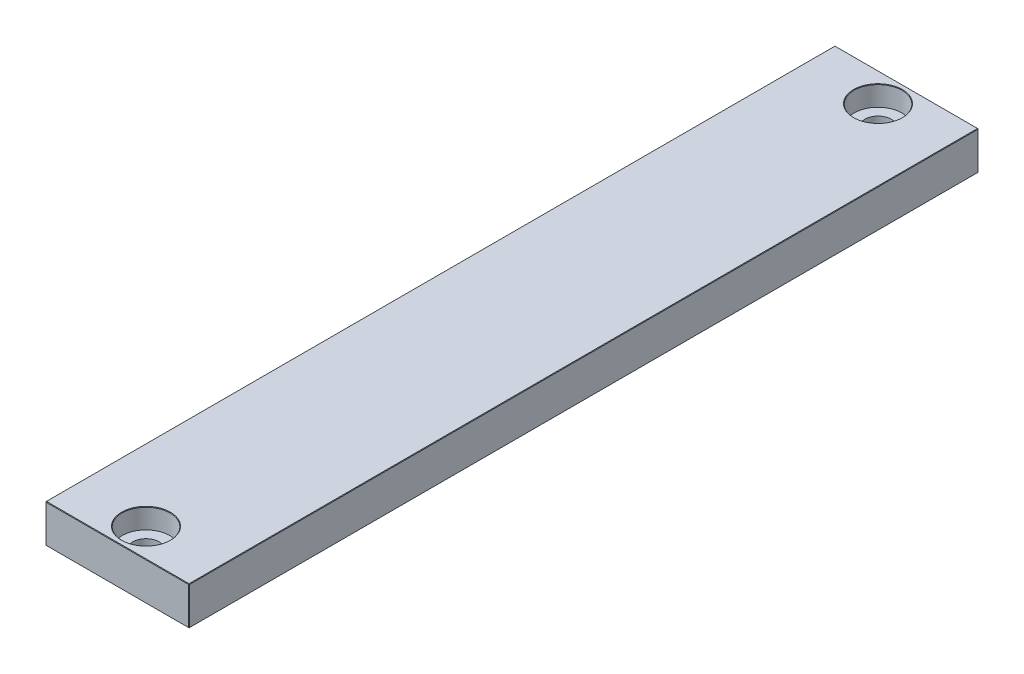
ISO-10303-21;
HEADER;
FILE_DESCRIPTION(('STEP AP214'),'2;1');
FILE_NAME('part.step','',(''),(''),'','','');
FILE_SCHEMA(('AUTOMOTIVE_DESIGN { 1 0 10303 214 1 1 1 1 }'));
ENDSEC;
DATA;
#1=APPLICATION_CONTEXT('core data for automotive mechanical design processes');
#2=APPLICATION_PROTOCOL_DEFINITION('international standard','automotive_design',2000,#1);
#3=PRODUCT_CONTEXT('',#1,'mechanical');
#4=PRODUCT('Part','Part','',(#3));
#5=PRODUCT_RELATED_PRODUCT_CATEGORY('part','',(#4));
#6=PRODUCT_DEFINITION_FORMATION('','',#4);
#7=PRODUCT_DEFINITION_CONTEXT('part definition',#1,'design');
#8=PRODUCT_DEFINITION('design','',#6,#7);
#9=PRODUCT_DEFINITION_SHAPE('','',#8);
#10=(LENGTH_UNIT() NAMED_UNIT(*) SI_UNIT(.MILLI.,.METRE.));
#11=(NAMED_UNIT(*) PLANE_ANGLE_UNIT() SI_UNIT($,.RADIAN.));
#12=(NAMED_UNIT(*) SI_UNIT($,.STERADIAN.) SOLID_ANGLE_UNIT());
#13=UNCERTAINTY_MEASURE_WITH_UNIT(LENGTH_MEASURE(1.E-05),#10,'distance_accuracy_value','');
#14=(GEOMETRIC_REPRESENTATION_CONTEXT(3) GLOBAL_UNCERTAINTY_ASSIGNED_CONTEXT((#13)) GLOBAL_UNIT_ASSIGNED_CONTEXT((#10,
#11,#12)) REPRESENTATION_CONTEXT('',''));
#15=CARTESIAN_POINT('',(0.,0.,0.));
#16=DIRECTION('',(0.,0.,1.));
#17=DIRECTION('',(1.,0.,0.));
#18=AXIS2_PLACEMENT_3D('',#15,#16,#17);
#19=CARTESIAN_POINT('',(0.,8.,-76.5));
#20=DIRECTION('',(0.,-1.,0.));
#21=DIRECTION('',(0.,0.,-1.));
#22=AXIS2_PLACEMENT_3D('',#19,#20,#21);
#23=CYLINDRICAL_SURFACE('',#22,2.75);
#24=CARTESIAN_POINT('',(0.,0.100000000000027,-76.5));
#25=DIRECTION('',(0.,-1.,0.));
#26=DIRECTION('',(0.,0.,-1.));
#27=AXIS2_PLACEMENT_3D('',#24,#25,#26);
#28=CIRCLE('',#27,2.75);
#29=CARTESIAN_POINT('',(0.,0.100000000000027,-79.25));
#30=VERTEX_POINT('',#29);
#31=EDGE_CURVE('E266',#30,#30,#28,.T.);
#32=ORIENTED_EDGE('',*,*,#31,.T.);
#33=EDGE_LOOP('',(#32));
#34=FACE_BOUND('',#33,.T.);
#35=CARTESIAN_POINT('',(0.,3.8,-76.5));
#36=DIRECTION('',(0.,1.,0.));
#37=DIRECTION('',(0.,0.,1.));
#38=AXIS2_PLACEMENT_3D('',#35,#36,#37);
#39=CIRCLE('',#38,2.75);
#40=CARTESIAN_POINT('',(0.,3.8,-73.75));
#41=VERTEX_POINT('',#40);
#42=EDGE_CURVE('E155',#41,#41,#39,.T.);
#43=ORIENTED_EDGE('',*,*,#42,.T.);
#44=EDGE_LOOP('',(#43));
#45=FACE_BOUND('',#44,.T.);
#46=ADVANCED_FACE('F41',(#34,#45),#23,.F.);
#47=CARTESIAN_POINT('',(0.,8.,76.5));
#48=DIRECTION('',(0.,-1.,0.));
#49=DIRECTION('',(0.,0.,-1.));
#50=AXIS2_PLACEMENT_3D('',#47,#48,#49);
#51=CYLINDRICAL_SURFACE('',#50,2.75);
#52=CARTESIAN_POINT('',(0.,0.100000000000029,76.5));
#53=DIRECTION('',(0.,-1.,0.));
#54=DIRECTION('',(0.,0.,-1.));
#55=AXIS2_PLACEMENT_3D('',#52,#53,#54);
#56=CIRCLE('',#55,2.75);
#57=CARTESIAN_POINT('',(0.,0.100000000000029,73.75));
#58=VERTEX_POINT('',#57);
#59=EDGE_CURVE('E270',#58,#58,#56,.T.);
#60=ORIENTED_EDGE('',*,*,#59,.T.);
#61=EDGE_LOOP('',(#60));
#62=FACE_BOUND('',#61,.T.);
#63=CARTESIAN_POINT('',(0.,3.8,76.5));
#64=DIRECTION('',(0.,1.,0.));
#65=DIRECTION('',(0.,0.,1.));
#66=AXIS2_PLACEMENT_3D('',#63,#64,#65);
#67=CIRCLE('',#66,2.75);
#68=CARTESIAN_POINT('',(0.,3.8,79.25));
#69=VERTEX_POINT('',#68);
#70=EDGE_CURVE('E245',#69,#69,#67,.T.);
#71=ORIENTED_EDGE('',*,*,#70,.T.);
#72=EDGE_LOOP('',(#71));
#73=FACE_BOUND('',#72,.T.);
#74=ADVANCED_FACE('F439',(#62,#73),#51,.F.);
#75=CARTESIAN_POINT('',(0.,8.,0.));
#76=DIRECTION('',(0.,-1.,0.));
#77=DIRECTION('',(0.,0.,-1.));
#78=AXIS2_PLACEMENT_3D('',#75,#76,#77);
#79=PLANE('',#78);
#80=CARTESIAN_POINT('',(0.,8.,76.5));
#81=DIRECTION('',(0.,-1.,0.));
#82=DIRECTION('',(0.,0.,-1.));
#83=AXIS2_PLACEMENT_3D('',#80,#81,#82);
#84=CIRCLE('',#83,5.09999999999999);
#85=CARTESIAN_POINT('',(0.,8.,71.4));
#86=VERTEX_POINT('',#85);
#87=EDGE_CURVE('E295',#86,#86,#84,.T.);
#88=ORIENTED_EDGE('',*,*,#87,.T.);
#89=EDGE_LOOP('',(#88));
#90=FACE_BOUND('',#89,.T.);
#91=CARTESIAN_POINT('',(0.,8.,-76.5));
#92=DIRECTION('',(0.,-1.,0.));
#93=DIRECTION('',(0.,0.,-1.));
#94=AXIS2_PLACEMENT_3D('',#91,#92,#93);
#95=CIRCLE('',#94,5.09999999999999);
#96=CARTESIAN_POINT('',(0.,8.,-81.6));
#97=VERTEX_POINT('',#96);
#98=EDGE_CURVE('E291',#97,#97,#95,.T.);
#99=ORIENTED_EDGE('',*,*,#98,.T.);
#100=EDGE_LOOP('',(#99));
#101=FACE_BOUND('',#100,.T.);
#102=DIRECTION('',(0.,0.,1.));
#103=VECTOR('',#102,1.);
#104=CARTESIAN_POINT('',(-14.9,8.,0.));
#105=LINE('',#104,#103);
#106=CARTESIAN_POINT('',(-14.9,8.,-82.4));
#107=VERTEX_POINT('',#106);
#108=CARTESIAN_POINT('',(-14.9,8.,82.4));
#109=VERTEX_POINT('',#108);
#110=EDGE_CURVE('E281',#107,#109,#105,.T.);
#111=ORIENTED_EDGE('',*,*,#110,.T.);
#112=DIRECTION('',(1.,0.,0.));
#113=VECTOR('',#112,1.);
#114=CARTESIAN_POINT('',(0.,8.,82.4));
#115=LINE('',#114,#113);
#116=CARTESIAN_POINT('',(14.9,8.,82.4));
#117=VERTEX_POINT('',#116);
#118=EDGE_CURVE('E287',#109,#117,#115,.T.);
#119=ORIENTED_EDGE('',*,*,#118,.T.);
#120=DIRECTION('',(0.,0.,-1.));
#121=VECTOR('',#120,1.);
#122=CARTESIAN_POINT('',(14.9,8.,0.));
#123=LINE('',#122,#121);
#124=CARTESIAN_POINT('',(14.9,8.,-82.4));
#125=VERTEX_POINT('',#124);
#126=EDGE_CURVE('E284',#117,#125,#123,.T.);
#127=ORIENTED_EDGE('',*,*,#126,.T.);
#128=DIRECTION('',(-1.,0.,0.));
#129=VECTOR('',#128,1.);
#130=CARTESIAN_POINT('',(0.,8.,-82.4));
#131=LINE('',#130,#129);
#132=EDGE_CURVE('E278',#125,#107,#131,.T.);
#133=ORIENTED_EDGE('',*,*,#132,.T.);
#134=EDGE_LOOP('',(#111,#119,#127,#133));
#135=FACE_BOUND('',#134,.T.);
#136=ADVANCED_FACE('F407',(#90,#101,#135),#79,.F.);
#137=CARTESIAN_POINT('',(0.,0.,0.));
#138=DIRECTION('',(0.,-1.,0.));
#139=DIRECTION('',(0.,0.,-1.));
#140=AXIS2_PLACEMENT_3D('',#137,#138,#139);
#141=PLANE('',#140);
#142=CARTESIAN_POINT('',(0.,0.,-76.5));
#143=DIRECTION('',(0.,-1.,0.));
#144=DIRECTION('',(0.,0.,-1.));
#145=AXIS2_PLACEMENT_3D('',#142,#143,#144);
#146=CIRCLE('',#145,2.85000000000003);
#147=CARTESIAN_POINT('',(0.,0.,-79.35));
#148=VERTEX_POINT('',#147);
#149=EDGE_CURVE('E262',#148,#148,#146,.F.);
#150=ORIENTED_EDGE('',*,*,#149,.T.);
#151=EDGE_LOOP('',(#150));
#152=FACE_BOUND('',#151,.T.);
#153=CARTESIAN_POINT('',(0.,0.,76.5));
#154=DIRECTION('',(0.,-1.,0.));
#155=DIRECTION('',(0.,0.,-1.));
#156=AXIS2_PLACEMENT_3D('',#153,#154,#155);
#157=CIRCLE('',#156,2.85000000000003);
#158=CARTESIAN_POINT('',(0.,0.,73.65));
#159=VERTEX_POINT('',#158);
#160=EDGE_CURVE('E258',#159,#159,#157,.F.);
#161=ORIENTED_EDGE('',*,*,#160,.T.);
#162=EDGE_LOOP('',(#161));
#163=FACE_BOUND('',#162,.T.);
#164=DIRECTION('',(0.,0.,-1.));
#165=VECTOR('',#164,1.);
#166=CARTESIAN_POINT('',(-14.9,0.,-82.5));
#167=LINE('',#166,#165);
#168=CARTESIAN_POINT('',(-14.9,0.,82.4));
#169=VERTEX_POINT('',#168);
#170=CARTESIAN_POINT('',(-14.9,0.,-82.4));
#171=VERTEX_POINT('',#170);
#172=EDGE_CURVE('E143',#169,#171,#167,.T.);
#173=ORIENTED_EDGE('',*,*,#172,.T.);
#174=DIRECTION('',(1.,0.,0.));
#175=VECTOR('',#174,1.);
#176=CARTESIAN_POINT('',(15.,0.,-82.4));
#177=LINE('',#176,#175);
#178=CARTESIAN_POINT('',(14.9,0.,-82.4));
#179=VERTEX_POINT('',#178);
#180=EDGE_CURVE('E138',#171,#179,#177,.T.);
#181=ORIENTED_EDGE('',*,*,#180,.T.);
#182=DIRECTION('',(0.,0.,1.));
#183=VECTOR('',#182,1.);
#184=CARTESIAN_POINT('',(14.9,0.,82.5));
#185=LINE('',#184,#183);
#186=CARTESIAN_POINT('',(14.9,0.,82.4));
#187=VERTEX_POINT('',#186);
#188=EDGE_CURVE('E132',#179,#187,#185,.T.);
#189=ORIENTED_EDGE('',*,*,#188,.T.);
#190=DIRECTION('',(-1.,0.,0.));
#191=VECTOR('',#190,1.);
#192=CARTESIAN_POINT('',(-15.,0.,82.4));
#193=LINE('',#192,#191);
#194=EDGE_CURVE('E135',#187,#169,#193,.T.);
#195=ORIENTED_EDGE('',*,*,#194,.T.);
#196=EDGE_LOOP('',(#173,#181,#189,#195));
#197=FACE_BOUND('',#196,.T.);
#198=ADVANCED_FACE('F134',(#152,#163,#197),#141,.T.);
#199=CARTESIAN_POINT('',(15.,8.,82.5));
#200=DIRECTION('',(-1.,0.,0.));
#201=DIRECTION('',(0.,0.,1.));
#202=AXIS2_PLACEMENT_3D('',#199,#200,#201);
#203=PLANE('',#202);
#204=DIRECTION('',(0.,0.,-1.));
#205=VECTOR('',#204,1.);
#206=CARTESIAN_POINT('',(15.,0.100000000000003,-82.5));
#207=LINE('',#206,#205);
#208=CARTESIAN_POINT('',(15.,0.100000000000003,82.4));
#209=VERTEX_POINT('',#208);
#210=CARTESIAN_POINT('',(15.,0.100000000000003,-82.4));
#211=VERTEX_POINT('',#210);
#212=EDGE_CURVE('E168',#209,#211,#207,.T.);
#213=ORIENTED_EDGE('',*,*,#212,.T.);
#214=DIRECTION('',(0.,1.,0.));
#215=VECTOR('',#214,1.);
#216=CARTESIAN_POINT('',(15.,8.,-82.4));
#217=LINE('',#216,#215);
#218=CARTESIAN_POINT('',(15.,7.9,-82.4));
#219=VERTEX_POINT('',#218);
#220=EDGE_CURVE('E324',#211,#219,#217,.T.);
#221=ORIENTED_EDGE('',*,*,#220,.T.);
#222=DIRECTION('',(0.,0.,1.));
#223=VECTOR('',#222,1.);
#224=CARTESIAN_POINT('',(15.,7.9,82.5));
#225=LINE('',#224,#223);
#226=CARTESIAN_POINT('',(15.,7.9,82.4));
#227=VERTEX_POINT('',#226);
#228=EDGE_CURVE('E316',#219,#227,#225,.T.);
#229=ORIENTED_EDGE('',*,*,#228,.T.);
#230=DIRECTION('',(0.,-1.,0.));
#231=VECTOR('',#230,1.);
#232=CARTESIAN_POINT('',(15.,8.,82.4));
#233=LINE('',#232,#231);
#234=EDGE_CURVE('E319',#227,#209,#233,.T.);
#235=ORIENTED_EDGE('',*,*,#234,.T.);
#236=EDGE_LOOP('',(#213,#221,#229,#235));
#237=FACE_BOUND('',#236,.T.);
#238=ADVANCED_FACE('F382',(#237),#203,.F.);
#239=CARTESIAN_POINT('',(-15.,8.,-82.5));
#240=DIRECTION('',(0.,0.,1.));
#241=DIRECTION('',(1.,0.,0.));
#242=AXIS2_PLACEMENT_3D('',#239,#240,#241);
#243=PLANE('',#242);
#244=DIRECTION('',(1.,0.,0.));
#245=VECTOR('',#244,1.);
#246=CARTESIAN_POINT('',(-15.,7.9,-82.5));
#247=LINE('',#246,#245);
#248=CARTESIAN_POINT('',(-14.9,7.9,-82.5));
#249=VERTEX_POINT('',#248);
#250=CARTESIAN_POINT('',(14.9,7.9,-82.5));
#251=VERTEX_POINT('',#250);
#252=EDGE_CURVE('E303',#249,#251,#247,.T.);
#253=ORIENTED_EDGE('',*,*,#252,.T.);
#254=DIRECTION('',(0.,-1.,0.));
#255=VECTOR('',#254,1.);
#256=CARTESIAN_POINT('',(14.9,8.,-82.5));
#257=LINE('',#256,#255);
#258=CARTESIAN_POINT('',(14.9,0.100000000000003,-82.5));
#259=VERTEX_POINT('',#258);
#260=EDGE_CURVE('E312',#251,#259,#257,.T.);
#261=ORIENTED_EDGE('',*,*,#260,.T.);
#262=DIRECTION('',(-1.,0.,0.));
#263=VECTOR('',#262,1.);
#264=CARTESIAN_POINT('',(-15.,0.100000000000003,-82.5));
#265=LINE('',#264,#263);
#266=CARTESIAN_POINT('',(-14.9,0.100000000000003,-82.5));
#267=VERTEX_POINT('',#266);
#268=EDGE_CURVE('E309',#259,#267,#265,.T.);
#269=ORIENTED_EDGE('',*,*,#268,.T.);
#270=DIRECTION('',(0.,1.,0.));
#271=VECTOR('',#270,1.);
#272=CARTESIAN_POINT('',(-14.9,8.,-82.5));
#273=LINE('',#272,#271);
#274=EDGE_CURVE('E306',#267,#249,#273,.T.);
#275=ORIENTED_EDGE('',*,*,#274,.T.);
#276=EDGE_LOOP('',(#253,#261,#269,#275));
#277=FACE_BOUND('',#276,.T.);
#278=ADVANCED_FACE('F395',(#277),#243,.F.);
#279=CARTESIAN_POINT('',(-15.,8.,82.5));
#280=DIRECTION('',(1.,0.,0.));
#281=DIRECTION('',(0.,0.,-1.));
#282=AXIS2_PLACEMENT_3D('',#279,#280,#281);
#283=PLANE('',#282);
#284=DIRECTION('',(0.,0.,-1.));
#285=VECTOR('',#284,1.);
#286=CARTESIAN_POINT('',(-15.,7.9,82.5));
#287=LINE('',#286,#285);
#288=CARTESIAN_POINT('',(-15.,7.9,82.4));
#289=VERTEX_POINT('',#288);
#290=CARTESIAN_POINT('',(-15.,7.9,-82.4));
#291=VERTEX_POINT('',#290);
#292=EDGE_CURVE('E328',#289,#291,#287,.T.);
#293=ORIENTED_EDGE('',*,*,#292,.T.);
#294=DIRECTION('',(0.,-1.,0.));
#295=VECTOR('',#294,1.);
#296=CARTESIAN_POINT('',(-15.,8.,-82.4));
#297=LINE('',#296,#295);
#298=CARTESIAN_POINT('',(-15.,0.100000000000003,-82.4));
#299=VERTEX_POINT('',#298);
#300=EDGE_CURVE('E337',#291,#299,#297,.T.);
#301=ORIENTED_EDGE('',*,*,#300,.T.);
#302=DIRECTION('',(0.,0.,1.));
#303=VECTOR('',#302,1.);
#304=CARTESIAN_POINT('',(-15.,0.100000000000003,82.5));
#305=LINE('',#304,#303);
#306=CARTESIAN_POINT('',(-15.,0.100000000000003,82.4));
#307=VERTEX_POINT('',#306);
#308=EDGE_CURVE('E334',#299,#307,#305,.T.);
#309=ORIENTED_EDGE('',*,*,#308,.T.);
#310=DIRECTION('',(0.,1.,0.));
#311=VECTOR('',#310,1.);
#312=CARTESIAN_POINT('',(-15.,8.,82.4));
#313=LINE('',#312,#311);
#314=EDGE_CURVE('E331',#307,#289,#313,.T.);
#315=ORIENTED_EDGE('',*,*,#314,.T.);
#316=EDGE_LOOP('',(#293,#301,#309,#315));
#317=FACE_BOUND('',#316,.T.);
#318=ADVANCED_FACE('F459',(#317),#283,.F.);
#319=CARTESIAN_POINT('',(-15.,8.,82.5));
#320=DIRECTION('',(0.,0.,-1.));
#321=DIRECTION('',(-1.,0.,0.));
#322=AXIS2_PLACEMENT_3D('',#319,#320,#321);
#323=PLANE('',#322);
#324=DIRECTION('',(1.,0.,0.));
#325=VECTOR('',#324,1.);
#326=CARTESIAN_POINT('',(15.,0.100000000000003,82.5));
#327=LINE('',#326,#325);
#328=CARTESIAN_POINT('',(-14.9,0.100000000000003,82.5));
#329=VERTEX_POINT('',#328);
#330=CARTESIAN_POINT('',(14.9,0.100000000000003,82.5));
#331=VERTEX_POINT('',#330);
#332=EDGE_CURVE('E52',#329,#331,#327,.T.);
#333=ORIENTED_EDGE('',*,*,#332,.T.);
#334=DIRECTION('',(0.,1.,0.));
#335=VECTOR('',#334,1.);
#336=CARTESIAN_POINT('',(14.9,8.,82.5));
#337=LINE('',#336,#335);
#338=CARTESIAN_POINT('',(14.9,7.9,82.5));
#339=VERTEX_POINT('',#338);
#340=EDGE_CURVE('E11',#331,#339,#337,.T.);
#341=ORIENTED_EDGE('',*,*,#340,.T.);
#342=DIRECTION('',(-1.,0.,0.));
#343=VECTOR('',#342,1.);
#344=CARTESIAN_POINT('',(-15.,7.9,82.5));
#345=LINE('',#344,#343);
#346=CARTESIAN_POINT('',(-14.9,7.9,82.5));
#347=VERTEX_POINT('',#346);
#348=EDGE_CURVE('E341',#339,#347,#345,.T.);
#349=ORIENTED_EDGE('',*,*,#348,.T.);
#350=DIRECTION('',(0.,-1.,0.));
#351=VECTOR('',#350,1.);
#352=CARTESIAN_POINT('',(-14.9,8.,82.5));
#353=LINE('',#352,#351);
#354=EDGE_CURVE('E63',#347,#329,#353,.T.);
#355=ORIENTED_EDGE('',*,*,#354,.T.);
#356=EDGE_LOOP('',(#333,#341,#349,#355));
#357=FACE_BOUND('',#356,.T.);
#358=ADVANCED_FACE('F418',(#357),#323,.F.);
#359=CARTESIAN_POINT('',(0.,3.8,76.5));
#360=DIRECTION('',(0.,1.,0.));
#361=DIRECTION('',(0.,0.,1.));
#362=AXIS2_PLACEMENT_3D('',#359,#360,#361);
#363=CYLINDRICAL_SURFACE('',#362,5.);
#364=CARTESIAN_POINT('',(0.,7.90000000000001,76.5));
#365=DIRECTION('',(0.,-1.,0.));
#366=DIRECTION('',(0.,0.,-1.));
#367=AXIS2_PLACEMENT_3D('',#364,#365,#366);
#368=CIRCLE('',#367,5.);
#369=CARTESIAN_POINT('',(0.,7.90000000000001,71.5));
#370=VERTEX_POINT('',#369);
#371=EDGE_CURVE('E274',#370,#370,#368,.F.);
#372=ORIENTED_EDGE('',*,*,#371,.T.);
#373=EDGE_LOOP('',(#372));
#374=FACE_BOUND('',#373,.T.);
#375=CARTESIAN_POINT('',(0.,3.8,76.5));
#376=DIRECTION('',(0.,1.,0.));
#377=DIRECTION('',(0.,0.,1.));
#378=AXIS2_PLACEMENT_3D('',#375,#376,#377);
#379=CIRCLE('',#378,5.);
#380=CARTESIAN_POINT('',(0.,3.8,81.5));
#381=VERTEX_POINT('',#380);
#382=EDGE_CURVE('E232',#381,#381,#379,.T.);
#383=ORIENTED_EDGE('',*,*,#382,.F.);
#384=EDGE_LOOP('',(#383));
#385=FACE_BOUND('',#384,.T.);
#386=ADVANCED_FACE('F458',(#374,#385),#363,.F.);
#387=CARTESIAN_POINT('',(0.,3.8,76.5));
#388=DIRECTION('',(0.,1.,0.));
#389=DIRECTION('',(0.,0.,1.));
#390=AXIS2_PLACEMENT_3D('',#387,#388,#389);
#391=PLANE('',#390);
#392=ORIENTED_EDGE('',*,*,#70,.F.);
#393=EDGE_LOOP('',(#392));
#394=FACE_BOUND('',#393,.T.);
#395=ORIENTED_EDGE('',*,*,#382,.T.);
#396=EDGE_LOOP('',(#395));
#397=FACE_BOUND('',#396,.T.);
#398=ADVANCED_FACE('F614',(#394,#397),#391,.T.);
#399=CARTESIAN_POINT('',(0.,3.8,-76.5));
#400=DIRECTION('',(0.,1.,0.));
#401=DIRECTION('',(0.,0.,1.));
#402=AXIS2_PLACEMENT_3D('',#399,#400,#401);
#403=CYLINDRICAL_SURFACE('',#402,5.);
#404=CARTESIAN_POINT('',(0.,7.90000000000001,-76.5));
#405=DIRECTION('',(0.,-1.,0.));
#406=DIRECTION('',(0.,0.,-1.));
#407=AXIS2_PLACEMENT_3D('',#404,#405,#406);
#408=CIRCLE('',#407,5.);
#409=CARTESIAN_POINT('',(0.,7.90000000000001,-81.5));
#410=VERTEX_POINT('',#409);
#411=EDGE_CURVE('E299',#410,#410,#408,.F.);
#412=ORIENTED_EDGE('',*,*,#411,.T.);
#413=EDGE_LOOP('',(#412));
#414=FACE_BOUND('',#413,.T.);
#415=CARTESIAN_POINT('',(0.,3.8,-76.5));
#416=DIRECTION('',(0.,1.,0.));
#417=DIRECTION('',(0.,0.,1.));
#418=AXIS2_PLACEMENT_3D('',#415,#416,#417);
#419=CIRCLE('',#418,5.);
#420=CARTESIAN_POINT('',(0.,3.8,-71.5));
#421=VERTEX_POINT('',#420);
#422=EDGE_CURVE('E239',#421,#421,#419,.T.);
#423=ORIENTED_EDGE('',*,*,#422,.F.);
#424=EDGE_LOOP('',(#423));
#425=FACE_BOUND('',#424,.T.);
#426=ADVANCED_FACE('F606',(#414,#425),#403,.F.);
#427=CARTESIAN_POINT('',(0.,3.8,-76.5));
#428=DIRECTION('',(0.,1.,0.));
#429=DIRECTION('',(0.,0.,1.));
#430=AXIS2_PLACEMENT_3D('',#427,#428,#429);
#431=PLANE('',#430);
#432=ORIENTED_EDGE('',*,*,#42,.F.);
#433=EDGE_LOOP('',(#432));
#434=FACE_BOUND('',#433,.T.);
#435=ORIENTED_EDGE('',*,*,#422,.T.);
#436=EDGE_LOOP('',(#435));
#437=FACE_BOUND('',#436,.T.);
#438=ADVANCED_FACE('F475',(#434,#437),#431,.T.);
#439=CARTESIAN_POINT('',(0.,0.,-76.5));
#440=DIRECTION('',(0.,-1.,0.));
#441=DIRECTION('',(0.,0.,-1.));
#442=AXIS2_PLACEMENT_3D('',#439,#440,#441);
#443=CONICAL_SURFACE('',#442,2.85000000000003,0.785398163397472);
#444=ORIENTED_EDGE('',*,*,#31,.F.);
#445=EDGE_LOOP('',(#444));
#446=FACE_BOUND('',#445,.T.);
#447=ORIENTED_EDGE('',*,*,#149,.F.);
#448=EDGE_LOOP('',(#447));
#449=FACE_BOUND('',#448,.T.);
#450=ADVANCED_FACE('F468',(#446,#449),#443,.F.);
#451=CARTESIAN_POINT('',(0.,0.,76.5));
#452=DIRECTION('',(0.,-1.,0.));
#453=DIRECTION('',(0.,0.,-1.));
#454=AXIS2_PLACEMENT_3D('',#451,#452,#453);
#455=CONICAL_SURFACE('',#454,2.85000000000003,0.785398163397468);
#456=ORIENTED_EDGE('',*,*,#59,.F.);
#457=EDGE_LOOP('',(#456));
#458=FACE_BOUND('',#457,.T.);
#459=ORIENTED_EDGE('',*,*,#160,.F.);
#460=EDGE_LOOP('',(#459));
#461=FACE_BOUND('',#460,.T.);
#462=ADVANCED_FACE('F474',(#458,#461),#455,.F.);
#463=CARTESIAN_POINT('',(0.,7.90000000000001,76.5));
#464=DIRECTION('',(0.,1.,0.));
#465=DIRECTION('',(0.,0.,1.));
#466=AXIS2_PLACEMENT_3D('',#463,#464,#465);
#467=CONICAL_SURFACE('',#466,5.,0.785398163397461);
#468=ORIENTED_EDGE('',*,*,#87,.F.);
#469=EDGE_LOOP('',(#468));
#470=FACE_BOUND('',#469,.T.);
#471=ORIENTED_EDGE('',*,*,#371,.F.);
#472=EDGE_LOOP('',(#471));
#473=FACE_BOUND('',#472,.T.);
#474=ADVANCED_FACE('F482',(#470,#473),#467,.F.);
#475=CARTESIAN_POINT('',(0.,7.90000000000001,-76.5));
#476=DIRECTION('',(0.,1.,0.));
#477=DIRECTION('',(0.,0.,1.));
#478=AXIS2_PLACEMENT_3D('',#475,#476,#477);
#479=CONICAL_SURFACE('',#478,5.,0.785398163397461);
#480=ORIENTED_EDGE('',*,*,#98,.F.);
#481=EDGE_LOOP('',(#480));
#482=FACE_BOUND('',#481,.T.);
#483=ORIENTED_EDGE('',*,*,#411,.F.);
#484=EDGE_LOOP('',(#483));
#485=FACE_BOUND('',#484,.T.);
#486=ADVANCED_FACE('F489',(#482,#485),#479,.F.);
#487=CARTESIAN_POINT('',(-14.9,8.,82.5));
#488=DIRECTION('',(0.707106781186548,0.,-0.707106781186548));
#489=DIRECTION('',(0.,-1.,0.));
#490=AXIS2_PLACEMENT_3D('',#487,#488,#489);
#491=PLANE('',#490);
#492=DIRECTION('',(-0.707106781186548,0.,-0.707106781186548));
#493=VECTOR('',#492,1.);
#494=CARTESIAN_POINT('',(-15.,7.9,82.4));
#495=LINE('',#494,#493);
#496=EDGE_CURVE('E46',#289,#347,#495,.F.);
#497=ORIENTED_EDGE('',*,*,#496,.F.);
#498=ORIENTED_EDGE('',*,*,#314,.F.);
#499=DIRECTION('',(0.707106781186548,0.,0.707106781186548));
#500=VECTOR('',#499,1.);
#501=CARTESIAN_POINT('',(-15.,0.100000000000003,82.4));
#502=LINE('',#501,#500);
#503=EDGE_CURVE('E226',#329,#307,#502,.F.);
#504=ORIENTED_EDGE('',*,*,#503,.F.);
#505=ORIENTED_EDGE('',*,*,#354,.F.);
#506=EDGE_LOOP('',(#497,#498,#504,#505));
#507=FACE_BOUND('',#506,.T.);
#508=ADVANCED_FACE('F44',(#507),#491,.F.);
#509=CARTESIAN_POINT('',(-15.,7.9,82.4));
#510=DIRECTION('',(-0.577350269189626,0.577350269189626,0.577350269189626));
#511=DIRECTION('',(0.707106781186547,0.,0.707106781186547));
#512=AXIS2_PLACEMENT_3D('',#509,#510,#511);
#513=PLANE('',#512);
#514=DIRECTION('',(0.707106781186548,0.707106781186548,0.));
#515=VECTOR('',#514,1.);
#516=CARTESIAN_POINT('',(-15.,7.9,82.4));
#517=LINE('',#516,#515);
#518=EDGE_CURVE('E219',#289,#109,#517,.T.);
#519=ORIENTED_EDGE('',*,*,#518,.F.);
#520=ORIENTED_EDGE('',*,*,#496,.T.);
#521=DIRECTION('',(0.,-0.707106781186548,0.707106781186548));
#522=VECTOR('',#521,1.);
#523=CARTESIAN_POINT('',(-14.9,7.95,82.45));
#524=LINE('',#523,#522);
#525=EDGE_CURVE('E223',#109,#347,#524,.T.);
#526=ORIENTED_EDGE('',*,*,#525,.F.);
#527=EDGE_LOOP('',(#519,#520,#526));
#528=FACE_BOUND('',#527,.T.);
#529=ADVANCED_FACE('F573',(#528),#513,.T.);
#530=CARTESIAN_POINT('',(-15.,0.100000000000003,82.4));
#531=DIRECTION('',(-0.577350269189626,-0.577350269189626,0.577350269189626));
#532=DIRECTION('',(0.707106781186547,0.,0.707106781186547));
#533=AXIS2_PLACEMENT_3D('',#530,#531,#532);
#534=PLANE('',#533);
#535=DIRECTION('',(0.,0.707106781186548,0.707106781186548));
#536=VECTOR('',#535,1.);
#537=CARTESIAN_POINT('',(-14.9,0.0500000000000014,82.45));
#538=LINE('',#537,#536);
#539=EDGE_CURVE('E152',#329,#169,#538,.F.);
#540=ORIENTED_EDGE('',*,*,#539,.F.);
#541=ORIENTED_EDGE('',*,*,#503,.T.);
#542=DIRECTION('',(0.707106781186548,-0.707106781186548,0.));
#543=VECTOR('',#542,1.);
#544=CARTESIAN_POINT('',(-15.,0.100000000000003,82.4));
#545=LINE('',#544,#543);
#546=EDGE_CURVE('E215',#169,#307,#545,.F.);
#547=ORIENTED_EDGE('',*,*,#546,.F.);
#548=EDGE_LOOP('',(#540,#541,#547));
#549=FACE_BOUND('',#548,.T.);
#550=ADVANCED_FACE('F421',(#549),#534,.T.);
#551=CARTESIAN_POINT('',(0.,8.,82.4));
#552=DIRECTION('',(0.,-0.707106781186548,-0.707106781186548));
#553=DIRECTION('',(1.,0.,0.));
#554=AXIS2_PLACEMENT_3D('',#551,#552,#553);
#555=PLANE('',#554);
#556=ORIENTED_EDGE('',*,*,#525,.T.);
#557=ORIENTED_EDGE('',*,*,#348,.F.);
#558=DIRECTION('',(0.,0.707106781186548,-0.707106781186548));
#559=VECTOR('',#558,1.);
#560=CARTESIAN_POINT('',(14.9,7.9,82.5));
#561=LINE('',#560,#559);
#562=EDGE_CURVE('E206',#117,#339,#561,.F.);
#563=ORIENTED_EDGE('',*,*,#562,.F.);
#564=ORIENTED_EDGE('',*,*,#118,.F.);
#565=EDGE_LOOP('',(#556,#557,#563,#564));
#566=FACE_BOUND('',#565,.T.);
#567=ADVANCED_FACE('F411',(#566),#555,.F.);
#568=CARTESIAN_POINT('',(-14.9,8.,0.));
#569=DIRECTION('',(0.707106781186548,-0.707106781186548,0.));
#570=DIRECTION('',(0.,0.,1.));
#571=AXIS2_PLACEMENT_3D('',#568,#569,#570);
#572=PLANE('',#571);
#573=ORIENTED_EDGE('',*,*,#518,.T.);
#574=ORIENTED_EDGE('',*,*,#110,.F.);
#575=DIRECTION('',(-0.707106781186547,-0.707106781186547,0.));
#576=VECTOR('',#575,1.);
#577=CARTESIAN_POINT('',(-14.95,7.95000000000001,-82.4));
#578=LINE('',#577,#576);
#579=EDGE_CURVE('E202',#291,#107,#578,.F.);
#580=ORIENTED_EDGE('',*,*,#579,.F.);
#581=ORIENTED_EDGE('',*,*,#292,.F.);
#582=EDGE_LOOP('',(#573,#574,#580,#581));
#583=FACE_BOUND('',#582,.T.);
#584=ADVANCED_FACE('F406',(#583),#572,.F.);
#585=CARTESIAN_POINT('',(-15.,8.,-82.4));
#586=DIRECTION('',(0.707106781186597,0.,0.707106781186499));
#587=DIRECTION('',(0.,-1.,0.));
#588=AXIS2_PLACEMENT_3D('',#585,#586,#587);
#589=PLANE('',#588);
#590=DIRECTION('',(-0.707106781186499,0.,0.707106781186597));
#591=VECTOR('',#590,1.);
#592=CARTESIAN_POINT('',(-14.9,0.100000000000003,-82.5));
#593=LINE('',#592,#591);
#594=EDGE_CURVE('E194',#299,#267,#593,.F.);
#595=ORIENTED_EDGE('',*,*,#594,.F.);
#596=ORIENTED_EDGE('',*,*,#300,.F.);
#597=DIRECTION('',(0.707106781186499,0.,-0.707106781186597));
#598=VECTOR('',#597,1.);
#599=CARTESIAN_POINT('',(-14.9,7.9,-82.5));
#600=LINE('',#599,#598);
#601=EDGE_CURVE('E198',#249,#291,#600,.F.);
#602=ORIENTED_EDGE('',*,*,#601,.F.);
#603=ORIENTED_EDGE('',*,*,#274,.F.);
#604=EDGE_LOOP('',(#595,#596,#602,#603));
#605=FACE_BOUND('',#604,.T.);
#606=ADVANCED_FACE('F400',(#605),#589,.F.);
#607=CARTESIAN_POINT('',(-15.,0.100000000000003,82.5));
#608=DIRECTION('',(-0.707106781186548,-0.707106781186548,0.));
#609=DIRECTION('',(0.,0.,-1.));
#610=AXIS2_PLACEMENT_3D('',#607,#608,#609);
#611=PLANE('',#610);
#612=ORIENTED_EDGE('',*,*,#546,.T.);
#613=ORIENTED_EDGE('',*,*,#308,.F.);
#614=DIRECTION('',(-0.707106781186547,0.707106781186547,0.));
#615=VECTOR('',#614,1.);
#616=CARTESIAN_POINT('',(-14.95,0.0499999999999945,-82.4));
#617=LINE('',#616,#615);
#618=EDGE_CURVE('E165',#171,#299,#617,.T.);
#619=ORIENTED_EDGE('',*,*,#618,.F.);
#620=ORIENTED_EDGE('',*,*,#172,.F.);
#621=EDGE_LOOP('',(#612,#613,#619,#620));
#622=FACE_BOUND('',#621,.T.);
#623=ADVANCED_FACE('F426',(#622),#611,.T.);
#624=CARTESIAN_POINT('',(-15.,0.100000000000003,82.5));
#625=DIRECTION('',(0.,-0.707106781186548,0.707106781186548));
#626=DIRECTION('',(-1.,0.,0.));
#627=AXIS2_PLACEMENT_3D('',#624,#625,#626);
#628=PLANE('',#627);
#629=ORIENTED_EDGE('',*,*,#539,.T.);
#630=ORIENTED_EDGE('',*,*,#194,.F.);
#631=DIRECTION('',(0.,-0.707106781186548,-0.707106781186548));
#632=VECTOR('',#631,1.);
#633=CARTESIAN_POINT('',(14.9,0.,82.4));
#634=LINE('',#633,#632);
#635=EDGE_CURVE('E149',#331,#187,#634,.T.);
#636=ORIENTED_EDGE('',*,*,#635,.F.);
#637=ORIENTED_EDGE('',*,*,#332,.F.);
#638=EDGE_LOOP('',(#629,#630,#636,#637));
#639=FACE_BOUND('',#638,.T.);
#640=ADVANCED_FACE('F148',(#639),#628,.T.);
#641=CARTESIAN_POINT('',(15.,8.,82.4));
#642=DIRECTION('',(-0.707106781186548,0.,-0.707106781186548));
#643=DIRECTION('',(0.,-1.,0.));
#644=AXIS2_PLACEMENT_3D('',#641,#642,#643);
#645=PLANE('',#644);
#646=DIRECTION('',(-0.707106781186548,0.,0.707106781186548));
#647=VECTOR('',#646,1.);
#648=CARTESIAN_POINT('',(14.9,7.9,82.5));
#649=LINE('',#648,#647);
#650=EDGE_CURVE('E209',#339,#227,#649,.F.);
#651=ORIENTED_EDGE('',*,*,#650,.F.);
#652=ORIENTED_EDGE('',*,*,#340,.F.);
#653=DIRECTION('',(0.707106781186548,0.,-0.707106781186548));
#654=VECTOR('',#653,1.);
#655=CARTESIAN_POINT('',(14.95,0.100000000000003,82.45));
#656=LINE('',#655,#654);
#657=EDGE_CURVE('E163',#209,#331,#656,.F.);
#658=ORIENTED_EDGE('',*,*,#657,.F.);
#659=ORIENTED_EDGE('',*,*,#234,.F.);
#660=EDGE_LOOP('',(#651,#652,#658,#659));
#661=FACE_BOUND('',#660,.T.);
#662=ADVANCED_FACE('F417',(#661),#645,.F.);
#663=CARTESIAN_POINT('',(14.9,7.9,82.5));
#664=DIRECTION('',(0.577350269189626,0.577350269189626,0.577350269189626));
#665=DIRECTION('',(0.707106781186547,0.,-0.707106781186547));
#666=AXIS2_PLACEMENT_3D('',#663,#664,#665);
#667=PLANE('',#666);
#668=ORIENTED_EDGE('',*,*,#562,.T.);
#669=ORIENTED_EDGE('',*,*,#650,.T.);
#670=DIRECTION('',(0.707106781186548,-0.707106781186548,0.));
#671=VECTOR('',#670,1.);
#672=CARTESIAN_POINT('',(14.95,7.95,82.4));
#673=LINE('',#672,#671);
#674=EDGE_CURVE('E186',#117,#227,#673,.T.);
#675=ORIENTED_EDGE('',*,*,#674,.F.);
#676=EDGE_LOOP('',(#668,#669,#675));
#677=FACE_BOUND('',#676,.T.);
#678=ADVANCED_FACE('F415',(#677),#667,.T.);
#679=CARTESIAN_POINT('',(-14.9,7.9,-82.5));
#680=DIRECTION('',(-0.577350269189679,0.577350269189599,-0.577350269189599));
#681=DIRECTION('',(-0.707106781186498,0.,0.707106781186597));
#682=AXIS2_PLACEMENT_3D('',#679,#680,#681);
#683=PLANE('',#682);
#684=ORIENTED_EDGE('',*,*,#601,.T.);
#685=ORIENTED_EDGE('',*,*,#579,.T.);
#686=DIRECTION('',(0.,0.707106781186547,0.707106781186547));
#687=VECTOR('',#686,1.);
#688=CARTESIAN_POINT('',(-14.9,7.9,-82.5));
#689=LINE('',#688,#687);
#690=EDGE_CURVE('E176',#249,#107,#689,.T.);
#691=ORIENTED_EDGE('',*,*,#690,.F.);
#692=EDGE_LOOP('',(#684,#685,#691));
#693=FACE_BOUND('',#692,.T.);
#694=ADVANCED_FACE('F403',(#693),#683,.T.);
#695=CARTESIAN_POINT('',(-14.9,0.100000000000003,-82.5));
#696=DIRECTION('',(-0.577350269189679,-0.577350269189599,-0.577350269189599));
#697=DIRECTION('',(-0.707106781186498,0.,0.707106781186597));
#698=AXIS2_PLACEMENT_3D('',#695,#696,#697);
#699=PLANE('',#698);
#700=ORIENTED_EDGE('',*,*,#618,.T.);
#701=ORIENTED_EDGE('',*,*,#594,.T.);
#702=DIRECTION('',(0.,-0.707106781186547,0.707106781186547));
#703=VECTOR('',#702,1.);
#704=CARTESIAN_POINT('',(-14.9,0.100000000000003,-82.5));
#705=LINE('',#704,#703);
#706=EDGE_CURVE('E170',#171,#267,#705,.F.);
#707=ORIENTED_EDGE('',*,*,#706,.F.);
#708=EDGE_LOOP('',(#700,#701,#707));
#709=FACE_BOUND('',#708,.T.);
#710=ADVANCED_FACE('F428',(#709),#699,.T.);
#711=CARTESIAN_POINT('',(14.9,0.,82.4));
#712=DIRECTION('',(0.577350269189626,-0.577350269189626,0.577350269189626));
#713=DIRECTION('',(0.707106781186547,0.,-0.707106781186547));
#714=AXIS2_PLACEMENT_3D('',#711,#712,#713);
#715=PLANE('',#714);
#716=ORIENTED_EDGE('',*,*,#657,.T.);
#717=ORIENTED_EDGE('',*,*,#635,.T.);
#718=DIRECTION('',(0.707106781186548,0.707106781186548,0.));
#719=VECTOR('',#718,1.);
#720=CARTESIAN_POINT('',(14.9,0.,82.4));
#721=LINE('',#720,#719);
#722=EDGE_CURVE('E160',#209,#187,#721,.F.);
#723=ORIENTED_EDGE('',*,*,#722,.F.);
#724=EDGE_LOOP('',(#716,#717,#723));
#725=FACE_BOUND('',#724,.T.);
#726=ADVANCED_FACE('F159',(#725),#715,.T.);
#727=CARTESIAN_POINT('',(14.9,8.,0.));
#728=DIRECTION('',(-0.707106781186548,-0.707106781186548,0.));
#729=DIRECTION('',(0.,0.,-1.));
#730=AXIS2_PLACEMENT_3D('',#727,#728,#729);
#731=PLANE('',#730);
#732=ORIENTED_EDGE('',*,*,#674,.T.);
#733=ORIENTED_EDGE('',*,*,#228,.F.);
#734=DIRECTION('',(-0.707106781186547,0.707106781186547,0.));
#735=VECTOR('',#734,1.);
#736=CARTESIAN_POINT('',(15.,7.9,-82.4));
#737=LINE('',#736,#735);
#738=EDGE_CURVE('E171',#125,#219,#737,.F.);
#739=ORIENTED_EDGE('',*,*,#738,.F.);
#740=ORIENTED_EDGE('',*,*,#126,.F.);
#741=EDGE_LOOP('',(#732,#733,#739,#740));
#742=FACE_BOUND('',#741,.T.);
#743=ADVANCED_FACE('F377',(#742),#731,.F.);
#744=CARTESIAN_POINT('',(0.,8.,-82.4));
#745=DIRECTION('',(0.,-0.707106781186548,0.707106781186548));
#746=DIRECTION('',(-1.,0.,0.));
#747=AXIS2_PLACEMENT_3D('',#744,#745,#746);
#748=PLANE('',#747);
#749=ORIENTED_EDGE('',*,*,#690,.T.);
#750=ORIENTED_EDGE('',*,*,#132,.F.);
#751=DIRECTION('',(0.,-0.707106781186547,-0.707106781186547));
#752=VECTOR('',#751,1.);
#753=CARTESIAN_POINT('',(14.9,7.95000000000001,-82.45));
#754=LINE('',#753,#752);
#755=EDGE_CURVE('E179',#251,#125,#754,.F.);
#756=ORIENTED_EDGE('',*,*,#755,.F.);
#757=ORIENTED_EDGE('',*,*,#252,.F.);
#758=EDGE_LOOP('',(#749,#750,#756,#757));
#759=FACE_BOUND('',#758,.T.);
#760=ADVANCED_FACE('F372',(#759),#748,.F.);
#761=CARTESIAN_POINT('',(-15.,0.100000000000003,-82.5));
#762=DIRECTION('',(0.,-0.707106781186548,-0.707106781186548));
#763=DIRECTION('',(1.,0.,0.));
#764=AXIS2_PLACEMENT_3D('',#761,#762,#763);
#765=PLANE('',#764);
#766=ORIENTED_EDGE('',*,*,#706,.T.);
#767=ORIENTED_EDGE('',*,*,#268,.F.);
#768=DIRECTION('',(0.,0.707106781186547,-0.707106781186547));
#769=VECTOR('',#768,1.);
#770=CARTESIAN_POINT('',(14.9,0.100000000000003,-82.5));
#771=LINE('',#770,#769);
#772=EDGE_CURVE('E357',#179,#259,#771,.T.);
#773=ORIENTED_EDGE('',*,*,#772,.F.);
#774=ORIENTED_EDGE('',*,*,#180,.F.);
#775=EDGE_LOOP('',(#766,#767,#773,#774));
#776=FACE_BOUND('',#775,.T.);
#777=ADVANCED_FACE('F391',(#776),#765,.T.);
#778=CARTESIAN_POINT('',(15.,0.100000000000003,82.5));
#779=DIRECTION('',(0.707106781186548,-0.707106781186548,0.));
#780=DIRECTION('',(0.,0.,1.));
#781=AXIS2_PLACEMENT_3D('',#778,#779,#780);
#782=PLANE('',#781);
#783=ORIENTED_EDGE('',*,*,#722,.T.);
#784=ORIENTED_EDGE('',*,*,#188,.F.);
#785=DIRECTION('',(-0.707106781186547,-0.707106781186547,0.));
#786=VECTOR('',#785,1.);
#787=CARTESIAN_POINT('',(14.95,0.0499999999999945,-82.4));
#788=LINE('',#787,#786);
#789=EDGE_CURVE('E354',#211,#179,#788,.T.);
#790=ORIENTED_EDGE('',*,*,#789,.F.);
#791=ORIENTED_EDGE('',*,*,#212,.F.);
#792=EDGE_LOOP('',(#783,#784,#790,#791));
#793=FACE_BOUND('',#792,.T.);
#794=ADVANCED_FACE('F167',(#793),#782,.T.);
#795=CARTESIAN_POINT('',(15.,7.9,-82.4));
#796=DIRECTION('',(0.577350269189679,0.577350269189599,-0.577350269189599));
#797=DIRECTION('',(-0.707106781186498,0.,-0.707106781186597));
#798=AXIS2_PLACEMENT_3D('',#795,#796,#797);
#799=PLANE('',#798);
#800=ORIENTED_EDGE('',*,*,#755,.T.);
#801=ORIENTED_EDGE('',*,*,#738,.T.);
#802=DIRECTION('',(0.707106781186499,0.,0.707106781186597));
#803=VECTOR('',#802,1.);
#804=CARTESIAN_POINT('',(15.,7.9,-82.4));
#805=LINE('',#804,#803);
#806=EDGE_CURVE('E351',#251,#219,#805,.T.);
#807=ORIENTED_EDGE('',*,*,#806,.F.);
#808=EDGE_LOOP('',(#800,#801,#807));
#809=FACE_BOUND('',#808,.T.);
#810=ADVANCED_FACE('F365',(#809),#799,.T.);
#811=CARTESIAN_POINT('',(14.9,0.100000000000003,-82.5));
#812=DIRECTION('',(0.577350269189679,-0.577350269189599,-0.577350269189599));
#813=DIRECTION('',(-0.707106781186498,0.,-0.707106781186597));
#814=AXIS2_PLACEMENT_3D('',#811,#812,#813);
#815=PLANE('',#814);
#816=ORIENTED_EDGE('',*,*,#789,.T.);
#817=ORIENTED_EDGE('',*,*,#772,.T.);
#818=DIRECTION('',(-0.707106781186499,0.,-0.707106781186597));
#819=VECTOR('',#818,1.);
#820=CARTESIAN_POINT('',(14.9,0.100000000000003,-82.5));
#821=LINE('',#820,#819);
#822=EDGE_CURVE('E348',#211,#259,#821,.T.);
#823=ORIENTED_EDGE('',*,*,#822,.F.);
#824=EDGE_LOOP('',(#816,#817,#823));
#825=FACE_BOUND('',#824,.T.);
#826=ADVANCED_FACE('F387',(#825),#815,.T.);
#827=CARTESIAN_POINT('',(14.9,8.,-82.5));
#828=DIRECTION('',(-0.707106781186597,0.,0.707106781186499));
#829=DIRECTION('',(0.,-1.,0.));
#830=AXIS2_PLACEMENT_3D('',#827,#828,#829);
#831=PLANE('',#830);
#832=ORIENTED_EDGE('',*,*,#806,.T.);
#833=ORIENTED_EDGE('',*,*,#220,.F.);
#834=ORIENTED_EDGE('',*,*,#822,.T.);
#835=ORIENTED_EDGE('',*,*,#260,.F.);
#836=EDGE_LOOP('',(#832,#833,#834,#835));
#837=FACE_BOUND('',#836,.T.);
#838=ADVANCED_FACE('F385',(#837),#831,.F.);
#839=CLOSED_SHELL('',(#46,#74,#136,#198,#238,#278,#318,#358,#386,#398,#426,#438,#450,#462,#474,
#486,#508,#529,#550,#567,#584,#606,#623,#640,#662,#678,#694,#710,#726,#743,#760,#777,#794,#810,
#826,#838));
#840=MANIFOLD_SOLID_BREP('B2',#839);
#841=ADVANCED_BREP_SHAPE_REPRESENTATION('',(#18,#840),#14);
#842=SHAPE_DEFINITION_REPRESENTATION(#9,#841);
ENDSEC;
END-ISO-10303-21;
